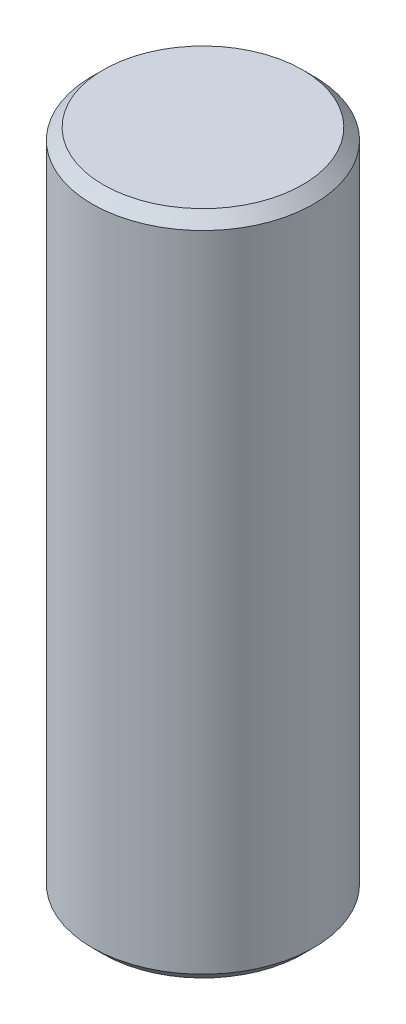
ISO-10303-21;
HEADER;
FILE_DESCRIPTION(('STEP AP214'),'2;1');
FILE_NAME('part.step','',(''),(''),'','','');
FILE_SCHEMA(('AUTOMOTIVE_DESIGN { 1 0 10303 214 1 1 1 1 }'));
ENDSEC;
DATA;
#1=APPLICATION_CONTEXT('core data for automotive mechanical design processes');
#2=APPLICATION_PROTOCOL_DEFINITION('international standard','automotive_design',2000,#1);
#3=PRODUCT_CONTEXT('',#1,'mechanical');
#4=PRODUCT('Part','Part','',(#3));
#5=PRODUCT_RELATED_PRODUCT_CATEGORY('part','',(#4));
#6=PRODUCT_DEFINITION_FORMATION('','',#4);
#7=PRODUCT_DEFINITION_CONTEXT('part definition',#1,'design');
#8=PRODUCT_DEFINITION('design','',#6,#7);
#9=PRODUCT_DEFINITION_SHAPE('','',#8);
#10=(LENGTH_UNIT() NAMED_UNIT(*) SI_UNIT(.MILLI.,.METRE.));
#11=(NAMED_UNIT(*) PLANE_ANGLE_UNIT() SI_UNIT($,.RADIAN.));
#12=(NAMED_UNIT(*) SI_UNIT($,.STERADIAN.) SOLID_ANGLE_UNIT());
#13=UNCERTAINTY_MEASURE_WITH_UNIT(LENGTH_MEASURE(1.E-05),#10,'distance_accuracy_value','');
#14=(GEOMETRIC_REPRESENTATION_CONTEXT(3) GLOBAL_UNCERTAINTY_ASSIGNED_CONTEXT((#13)) GLOBAL_UNIT_ASSIGNED_CONTEXT((#10,
#11,#12)) REPRESENTATION_CONTEXT('',''));
#15=CARTESIAN_POINT('',(0.,0.,0.));
#16=DIRECTION('',(0.,0.,1.));
#17=DIRECTION('',(1.,0.,0.));
#18=AXIS2_PLACEMENT_3D('',#15,#16,#17);
#19=CARTESIAN_POINT('',(0.,14.98,0.));
#20=DIRECTION('',(0.,-1.,0.));
#21=DIRECTION('',(0.,0.,-1.));
#22=AXIS2_PLACEMENT_3D('',#19,#20,#21);
#23=CYLINDRICAL_SURFACE('',#22,2.49);
#24=CARTESIAN_POINT('',(0.,0.250000000000004,0.));
#25=DIRECTION('',(0.,1.,0.));
#26=DIRECTION('',(0.,0.,1.));
#27=AXIS2_PLACEMENT_3D('',#24,#25,#26);
#28=CIRCLE('',#27,2.49);
#29=CARTESIAN_POINT('',(0.,0.250000000000004,2.49));
#30=VERTEX_POINT('',#29);
#31=EDGE_CURVE('E51',#30,#30,#28,.T.);
#32=ORIENTED_EDGE('',*,*,#31,.T.);
#33=EDGE_LOOP('',(#32));
#34=FACE_BOUND('',#33,.T.);
#35=CARTESIAN_POINT('',(0.,14.73,0.));
#36=DIRECTION('',(0.,1.,0.));
#37=DIRECTION('',(0.,0.,1.));
#38=AXIS2_PLACEMENT_3D('',#35,#36,#37);
#39=CIRCLE('',#38,2.49);
#40=CARTESIAN_POINT('',(0.,14.73,2.49));
#41=VERTEX_POINT('',#40);
#42=EDGE_CURVE('E56',#41,#41,#39,.F.);
#43=ORIENTED_EDGE('',*,*,#42,.T.);
#44=EDGE_LOOP('',(#43));
#45=FACE_BOUND('',#44,.T.);
#46=ADVANCED_FACE('F38',(#34,#45),#23,.T.);
#47=CARTESIAN_POINT('',(0.,14.98,0.));
#48=DIRECTION('',(0.,1.,0.));
#49=DIRECTION('',(0.,0.,1.));
#50=AXIS2_PLACEMENT_3D('',#47,#48,#49);
#51=PLANE('',#50);
#52=CARTESIAN_POINT('',(0.,14.98,0.));
#53=DIRECTION('',(0.,1.,0.));
#54=DIRECTION('',(0.,0.,1.));
#55=AXIS2_PLACEMENT_3D('',#52,#53,#54);
#56=CIRCLE('',#55,2.24);
#57=CARTESIAN_POINT('',(0.,14.98,2.24));
#58=VERTEX_POINT('',#57);
#59=EDGE_CURVE('E10',#58,#58,#56,.T.);
#60=ORIENTED_EDGE('',*,*,#59,.T.);
#61=EDGE_LOOP('',(#60));
#62=FACE_BOUND('',#61,.T.);
#63=ADVANCED_FACE('F73',(#62),#51,.T.);
#64=CARTESIAN_POINT('',(0.,0.,0.));
#65=DIRECTION('',(0.,1.,0.));
#66=DIRECTION('',(0.,0.,1.));
#67=AXIS2_PLACEMENT_3D('',#64,#65,#66);
#68=PLANE('',#67);
#69=CARTESIAN_POINT('',(0.,0.,0.));
#70=DIRECTION('',(0.,1.,0.));
#71=DIRECTION('',(0.,0.,1.));
#72=AXIS2_PLACEMENT_3D('',#69,#70,#71);
#73=CIRCLE('',#72,2.24);
#74=CARTESIAN_POINT('',(0.,0.,2.24));
#75=VERTEX_POINT('',#74);
#76=EDGE_CURVE('E46',#75,#75,#73,.F.);
#77=ORIENTED_EDGE('',*,*,#76,.T.);
#78=EDGE_LOOP('',(#77));
#79=FACE_BOUND('',#78,.T.);
#80=ADVANCED_FACE('F70',(#79),#68,.F.);
#81=CARTESIAN_POINT('',(0.,0.250000000000004,0.));
#82=DIRECTION('',(0.,1.,0.));
#83=DIRECTION('',(0.,0.,1.));
#84=AXIS2_PLACEMENT_3D('',#81,#82,#83);
#85=CONICAL_SURFACE('',#84,2.49,0.785398163397447);
#86=ORIENTED_EDGE('',*,*,#76,.F.);
#87=EDGE_LOOP('',(#86));
#88=FACE_BOUND('',#87,.T.);
#89=ORIENTED_EDGE('',*,*,#31,.F.);
#90=EDGE_LOOP('',(#89));
#91=FACE_BOUND('',#90,.T.);
#92=ADVANCED_FACE('F66',(#88,#91),#85,.T.);
#93=CARTESIAN_POINT('',(0.,14.98,0.));
#94=DIRECTION('',(0.,-1.,0.));
#95=DIRECTION('',(0.,0.,-1.));
#96=AXIS2_PLACEMENT_3D('',#93,#94,#95);
#97=CONICAL_SURFACE('',#96,2.24,0.78539816339745);
#98=ORIENTED_EDGE('',*,*,#42,.F.);
#99=EDGE_LOOP('',(#98));
#100=FACE_BOUND('',#99,.T.);
#101=ORIENTED_EDGE('',*,*,#59,.F.);
#102=EDGE_LOOP('',(#101));
#103=FACE_BOUND('',#102,.T.);
#104=ADVANCED_FACE('F40',(#100,#103),#97,.T.);
#105=CLOSED_SHELL('',(#46,#63,#80,#92,#104));
#106=MANIFOLD_SOLID_BREP('B2',#105);
#107=ADVANCED_BREP_SHAPE_REPRESENTATION('',(#18,#106),#14);
#108=SHAPE_DEFINITION_REPRESENTATION(#9,#107);
ENDSEC;
END-ISO-10303-21;
